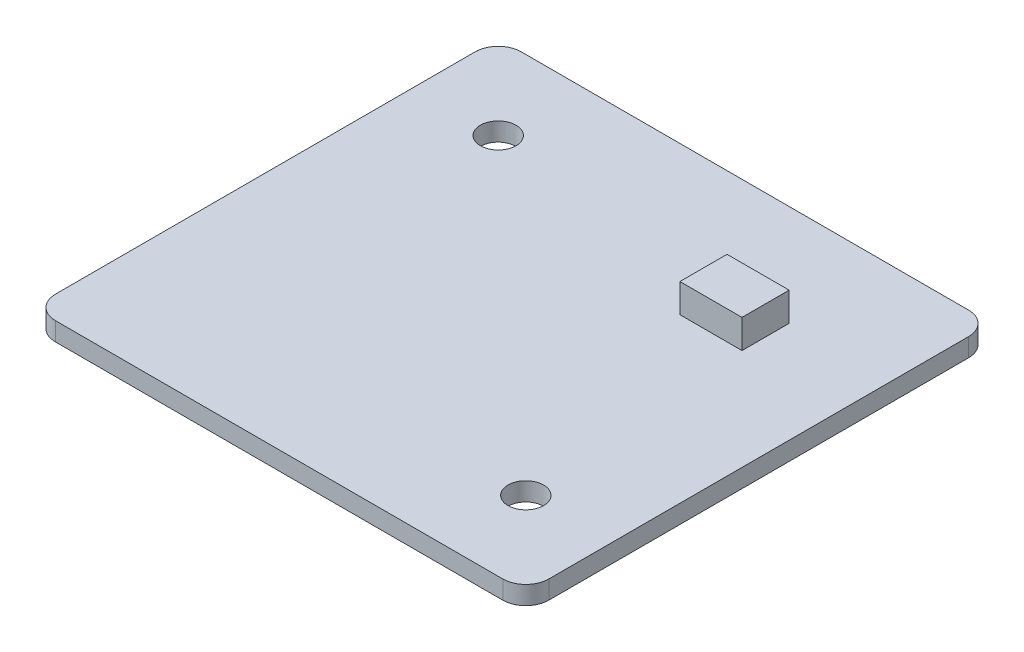
ISO-10303-21;
HEADER;
FILE_DESCRIPTION(('STEP AP214'),'2;1');
FILE_NAME('part.step','',(''),(''),'','','');
FILE_SCHEMA(('AUTOMOTIVE_DESIGN { 1 0 10303 214 1 1 1 1 }'));
ENDSEC;
DATA;
#1=APPLICATION_CONTEXT('core data for automotive mechanical design processes');
#2=APPLICATION_PROTOCOL_DEFINITION('international standard','automotive_design',2000,#1);
#3=PRODUCT_CONTEXT('',#1,'mechanical');
#4=PRODUCT('Part','Part','',(#3));
#5=PRODUCT_RELATED_PRODUCT_CATEGORY('part','',(#4));
#6=PRODUCT_DEFINITION_FORMATION('','',#4);
#7=PRODUCT_DEFINITION_CONTEXT('part definition',#1,'design');
#8=PRODUCT_DEFINITION('design','',#6,#7);
#9=PRODUCT_DEFINITION_SHAPE('','',#8);
#10=(LENGTH_UNIT() NAMED_UNIT(*) SI_UNIT(.MILLI.,.METRE.));
#11=(NAMED_UNIT(*) PLANE_ANGLE_UNIT() SI_UNIT($,.RADIAN.));
#12=(NAMED_UNIT(*) SI_UNIT($,.STERADIAN.) SOLID_ANGLE_UNIT());
#13=UNCERTAINTY_MEASURE_WITH_UNIT(LENGTH_MEASURE(1.E-05),#10,'distance_accuracy_value','');
#14=(GEOMETRIC_REPRESENTATION_CONTEXT(3) GLOBAL_UNCERTAINTY_ASSIGNED_CONTEXT((#13)) GLOBAL_UNIT_ASSIGNED_CONTEXT((#10,
#11,#12)) REPRESENTATION_CONTEXT('',''));
#15=CARTESIAN_POINT('',(0.,0.,0.));
#16=DIRECTION('',(0.,0.,1.));
#17=DIRECTION('',(1.,0.,0.));
#18=AXIS2_PLACEMENT_3D('',#15,#16,#17);
#19=CARTESIAN_POINT('',(0.,0.,0.));
#20=DIRECTION('',(0.,1.,0.));
#21=DIRECTION('',(0.,0.,1.));
#22=AXIS2_PLACEMENT_3D('',#19,#20,#21);
#23=PLANE('',#22);
#24=CARTESIAN_POINT('',(5.33072569364747,0.,3.8448984075977));
#25=DIRECTION('',(0.,1.,0.));
#26=DIRECTION('',(0.,0.,1.));
#27=AXIS2_PLACEMENT_3D('',#24,#25,#26);
#28=CIRCLE('',#27,1.55);
#29=CARTESIAN_POINT('',(5.33072569364747,0.,5.3948984075977));
#30=VERTEX_POINT('',#29);
#31=EDGE_CURVE('E200',#30,#30,#28,.T.);
#32=ORIENTED_EDGE('',*,*,#31,.T.);
#33=EDGE_LOOP('',(#32));
#34=FACE_BOUND('',#33,.T.);
#35=DIRECTION('',(1.,0.,0.));
#36=VECTOR('',#35,1.);
#37=CARTESIAN_POINT('',(-30.2692743063525,0.,11.1448984075977));
#38=LINE('',#37,#36);
#39=CARTESIAN_POINT('',(-28.2692743063525,0.,11.1448984075977));
#40=VERTEX_POINT('',#39);
#41=CARTESIAN_POINT('',(10.6307256936475,0.,11.1448984075977));
#42=VERTEX_POINT('',#41);
#43=EDGE_CURVE('E229',#40,#42,#38,.T.);
#44=ORIENTED_EDGE('',*,*,#43,.F.);
#45=CARTESIAN_POINT('',(-28.2692743063525,0.,9.1448984075977));
#46=DIRECTION('',(0.,1.,0.));
#47=DIRECTION('',(0.,0.,1.));
#48=AXIS2_PLACEMENT_3D('',#45,#46,#47);
#49=CIRCLE('',#48,2.);
#50=CARTESIAN_POINT('',(-30.2692743063525,0.,9.1448984075977));
#51=VERTEX_POINT('',#50);
#52=EDGE_CURVE('E247',#40,#51,#49,.F.);
#53=ORIENTED_EDGE('',*,*,#52,.T.);
#54=DIRECTION('',(0.,0.,1.));
#55=VECTOR('',#54,1.);
#56=CARTESIAN_POINT('',(-30.2692743063525,0.,-29.3551015924023));
#57=LINE('',#56,#55);
#58=CARTESIAN_POINT('',(-30.2692743063525,0.,-27.3551015924023));
#59=VERTEX_POINT('',#58);
#60=EDGE_CURVE('E210',#59,#51,#57,.T.);
#61=ORIENTED_EDGE('',*,*,#60,.F.);
#62=CARTESIAN_POINT('',(-28.2692743063525,0.,-27.3551015924023));
#63=DIRECTION('',(0.,1.,0.));
#64=DIRECTION('',(0.,0.,1.));
#65=AXIS2_PLACEMENT_3D('',#62,#63,#64);
#66=CIRCLE('',#65,2.);
#67=CARTESIAN_POINT('',(-28.2692743063525,0.,-29.3551015924023));
#68=VERTEX_POINT('',#67);
#69=EDGE_CURVE('E241',#59,#68,#66,.F.);
#70=ORIENTED_EDGE('',*,*,#69,.T.);
#71=DIRECTION('',(-1.,0.,0.));
#72=VECTOR('',#71,1.);
#73=CARTESIAN_POINT('',(-30.2692743063525,0.,-29.3551015924023));
#74=LINE('',#73,#72);
#75=CARTESIAN_POINT('',(10.6307256936475,0.,-29.3551015924023));
#76=VERTEX_POINT('',#75);
#77=EDGE_CURVE('E217',#76,#68,#74,.T.);
#78=ORIENTED_EDGE('',*,*,#77,.F.);
#79=CARTESIAN_POINT('',(10.6307256936475,0.,-27.3551015924023));
#80=DIRECTION('',(0.,1.,0.));
#81=DIRECTION('',(0.,0.,1.));
#82=AXIS2_PLACEMENT_3D('',#79,#80,#81);
#83=CIRCLE('',#82,2.);
#84=CARTESIAN_POINT('',(12.6307256936475,0.,-27.3551015924023));
#85=VERTEX_POINT('',#84);
#86=EDGE_CURVE('E245',#76,#85,#83,.F.);
#87=ORIENTED_EDGE('',*,*,#86,.T.);
#88=DIRECTION('',(0.,0.,-1.));
#89=VECTOR('',#88,1.);
#90=CARTESIAN_POINT('',(12.6307256936475,0.,-29.3551015924023));
#91=LINE('',#90,#89);
#92=CARTESIAN_POINT('',(12.6307256936475,0.,9.1448984075977));
#93=VERTEX_POINT('',#92);
#94=EDGE_CURVE('E232',#93,#85,#91,.T.);
#95=ORIENTED_EDGE('',*,*,#94,.F.);
#96=CARTESIAN_POINT('',(10.6307256936475,0.,9.1448984075977));
#97=DIRECTION('',(0.,1.,0.));
#98=DIRECTION('',(0.,0.,1.));
#99=AXIS2_PLACEMENT_3D('',#96,#97,#98);
#100=CIRCLE('',#99,2.);
#101=EDGE_CURVE('E243',#93,#42,#100,.F.);
#102=ORIENTED_EDGE('',*,*,#101,.T.);
#103=EDGE_LOOP('',(#44,#53,#61,#70,#78,#87,#95,#102));
#104=FACE_BOUND('',#103,.T.);
#105=CARTESIAN_POINT('',(-22.9692743063525,0.,-22.0551015924023));
#106=DIRECTION('',(0.,1.,0.));
#107=DIRECTION('',(0.,0.,1.));
#108=AXIS2_PLACEMENT_3D('',#105,#106,#107);
#109=CIRCLE('',#108,1.55);
#110=CARTESIAN_POINT('',(-22.9692743063525,0.,-20.5051015924023));
#111=VERTEX_POINT('',#110);
#112=EDGE_CURVE('E204',#111,#111,#109,.T.);
#113=ORIENTED_EDGE('',*,*,#112,.T.);
#114=EDGE_LOOP('',(#113));
#115=FACE_BOUND('',#114,.T.);
#116=DIRECTION('',(0.,0.,-1.));
#117=VECTOR('',#116,1.);
#118=CARTESIAN_POINT('',(-21.6692743063525,0.,5.8948984075977));
#119=LINE('',#118,#117);
#120=CARTESIAN_POINT('',(-21.6692743063525,0.,5.8948984075977));
#121=VERTEX_POINT('',#120);
#122=CARTESIAN_POINT('',(-21.6692743063525,0.,3.3348984075977));
#123=VERTEX_POINT('',#122);
#124=EDGE_CURVE('E165',#121,#123,#119,.T.);
#125=ORIENTED_EDGE('',*,*,#124,.F.);
#126=DIRECTION('',(-1.,0.,0.));
#127=VECTOR('',#126,1.);
#128=CARTESIAN_POINT('',(-21.6692743063525,0.,5.8948984075977));
#129=LINE('',#128,#127);
#130=CARTESIAN_POINT('',(-1.16927430635253,0.,5.8948984075977));
#131=VERTEX_POINT('',#130);
#132=EDGE_CURVE('E162',#131,#121,#129,.T.);
#133=ORIENTED_EDGE('',*,*,#132,.F.);
#134=DIRECTION('',(0.,0.,1.));
#135=VECTOR('',#134,1.);
#136=CARTESIAN_POINT('',(-1.16927430635253,0.,5.8948984075977));
#137=LINE('',#136,#135);
#138=CARTESIAN_POINT('',(-1.16927430635253,0.,3.3348984075977));
#139=VERTEX_POINT('',#138);
#140=EDGE_CURVE('E53',#139,#131,#137,.T.);
#141=ORIENTED_EDGE('',*,*,#140,.F.);
#142=DIRECTION('',(1.,0.,0.));
#143=VECTOR('',#142,1.);
#144=CARTESIAN_POINT('',(-21.6692743063525,0.,3.3348984075977));
#145=LINE('',#144,#143);
#146=EDGE_CURVE('E48',#123,#139,#145,.T.);
#147=ORIENTED_EDGE('',*,*,#146,.F.);
#148=EDGE_LOOP('',(#125,#133,#141,#147));
#149=FACE_BOUND('',#148,.T.);
#150=ADVANCED_FACE('F33',(#34,#104,#115,#149),#23,.F.);
#151=CARTESIAN_POINT('',(0.,1.6,0.));
#152=DIRECTION('',(0.,1.,0.));
#153=DIRECTION('',(0.,0.,1.));
#154=AXIS2_PLACEMENT_3D('',#151,#152,#153);
#155=PLANE('',#154);
#156=CARTESIAN_POINT('',(5.33072569364747,1.6,3.8448984075977));
#157=DIRECTION('',(0.,1.,0.));
#158=DIRECTION('',(0.,0.,1.));
#159=AXIS2_PLACEMENT_3D('',#156,#157,#158);
#160=CIRCLE('',#159,1.55);
#161=CARTESIAN_POINT('',(5.33072569364747,1.6,5.3948984075977));
#162=VERTEX_POINT('',#161);
#163=EDGE_CURVE('E201',#162,#162,#160,.T.);
#164=ORIENTED_EDGE('',*,*,#163,.F.);
#165=EDGE_LOOP('',(#164));
#166=FACE_BOUND('',#165,.T.);
#167=DIRECTION('',(0.,0.,1.));
#168=VECTOR('',#167,1.);
#169=CARTESIAN_POINT('',(-30.2692743063525,1.6,-29.3551015924023));
#170=LINE('',#169,#168);
#171=CARTESIAN_POINT('',(-30.2692743063525,1.6,-27.3551015924023));
#172=VERTEX_POINT('',#171);
#173=CARTESIAN_POINT('',(-30.2692743063525,1.6,9.1448984075977));
#174=VERTEX_POINT('',#173);
#175=EDGE_CURVE('E213',#172,#174,#170,.T.);
#176=ORIENTED_EDGE('',*,*,#175,.T.);
#177=CARTESIAN_POINT('',(-28.2692743063525,1.6,9.1448984075977));
#178=DIRECTION('',(0.,1.,0.));
#179=DIRECTION('',(0.,0.,1.));
#180=AXIS2_PLACEMENT_3D('',#177,#178,#179);
#181=CIRCLE('',#180,2.);
#182=CARTESIAN_POINT('',(-28.2692743063525,1.6,11.1448984075977));
#183=VERTEX_POINT('',#182);
#184=EDGE_CURVE('E260',#174,#183,#181,.T.);
#185=ORIENTED_EDGE('',*,*,#184,.T.);
#186=DIRECTION('',(1.,0.,0.));
#187=VECTOR('',#186,1.);
#188=CARTESIAN_POINT('',(-30.2692743063525,1.6,11.1448984075977));
#189=LINE('',#188,#187);
#190=CARTESIAN_POINT('',(10.6307256936475,1.6,11.1448984075977));
#191=VERTEX_POINT('',#190);
#192=EDGE_CURVE('E216',#183,#191,#189,.T.);
#193=ORIENTED_EDGE('',*,*,#192,.T.);
#194=CARTESIAN_POINT('',(10.6307256936475,1.6,9.1448984075977));
#195=DIRECTION('',(0.,1.,0.));
#196=DIRECTION('',(0.,0.,1.));
#197=AXIS2_PLACEMENT_3D('',#194,#195,#196);
#198=CIRCLE('',#197,2.);
#199=CARTESIAN_POINT('',(12.6307256936475,1.6,9.1448984075977));
#200=VERTEX_POINT('',#199);
#201=EDGE_CURVE('E256',#191,#200,#198,.T.);
#202=ORIENTED_EDGE('',*,*,#201,.T.);
#203=DIRECTION('',(0.,0.,-1.));
#204=VECTOR('',#203,1.);
#205=CARTESIAN_POINT('',(12.6307256936475,1.6,-29.3551015924023));
#206=LINE('',#205,#204);
#207=CARTESIAN_POINT('',(12.6307256936475,1.6,-27.3551015924023));
#208=VERTEX_POINT('',#207);
#209=EDGE_CURVE('E220',#200,#208,#206,.T.);
#210=ORIENTED_EDGE('',*,*,#209,.T.);
#211=CARTESIAN_POINT('',(10.6307256936475,1.6,-27.3551015924023));
#212=DIRECTION('',(0.,1.,0.));
#213=DIRECTION('',(0.,0.,1.));
#214=AXIS2_PLACEMENT_3D('',#211,#212,#213);
#215=CIRCLE('',#214,2.);
#216=CARTESIAN_POINT('',(10.6307256936475,1.6,-29.3551015924023));
#217=VERTEX_POINT('',#216);
#218=EDGE_CURVE('E258',#208,#217,#215,.T.);
#219=ORIENTED_EDGE('',*,*,#218,.T.);
#220=DIRECTION('',(-1.,0.,0.));
#221=VECTOR('',#220,1.);
#222=CARTESIAN_POINT('',(-30.2692743063525,1.6,-29.3551015924023));
#223=LINE('',#222,#221);
#224=CARTESIAN_POINT('',(-28.2692743063525,1.6,-29.3551015924023));
#225=VERTEX_POINT('',#224);
#226=EDGE_CURVE('E223',#217,#225,#223,.T.);
#227=ORIENTED_EDGE('',*,*,#226,.T.);
#228=CARTESIAN_POINT('',(-28.2692743063525,1.6,-27.3551015924023));
#229=DIRECTION('',(0.,1.,0.));
#230=DIRECTION('',(0.,0.,1.));
#231=AXIS2_PLACEMENT_3D('',#228,#229,#230);
#232=CIRCLE('',#231,2.);
#233=EDGE_CURVE('E254',#225,#172,#232,.T.);
#234=ORIENTED_EDGE('',*,*,#233,.T.);
#235=EDGE_LOOP('',(#176,#185,#193,#202,#210,#219,#227,#234));
#236=FACE_BOUND('',#235,.T.);
#237=CARTESIAN_POINT('',(-22.9692743063525,1.6,-22.0551015924023));
#238=DIRECTION('',(0.,1.,0.));
#239=DIRECTION('',(0.,0.,1.));
#240=AXIS2_PLACEMENT_3D('',#237,#238,#239);
#241=CIRCLE('',#240,1.55);
#242=CARTESIAN_POINT('',(-22.9692743063525,1.6,-20.5051015924023));
#243=VERTEX_POINT('',#242);
#244=EDGE_CURVE('E207',#243,#243,#241,.T.);
#245=ORIENTED_EDGE('',*,*,#244,.F.);
#246=EDGE_LOOP('',(#245));
#247=FACE_BOUND('',#246,.T.);
#248=DIRECTION('',(1.,0.,0.));
#249=VECTOR('',#248,1.);
#250=CARTESIAN_POINT('',(-1.56927430635253,1.6,-16.4551015924023));
#251=LINE('',#250,#249);
#252=CARTESIAN_POINT('',(-1.56927430635253,1.6,-16.4551015924023));
#253=VERTEX_POINT('',#252);
#254=CARTESIAN_POINT('',(3.83072569364747,1.6,-16.4551015924023));
#255=VERTEX_POINT('',#254);
#256=EDGE_CURVE('E169',#253,#255,#251,.T.);
#257=ORIENTED_EDGE('',*,*,#256,.F.);
#258=DIRECTION('',(0.,0.,1.));
#259=VECTOR('',#258,1.);
#260=CARTESIAN_POINT('',(-1.56927430635253,1.6,-20.5551015924023));
#261=LINE('',#260,#259);
#262=CARTESIAN_POINT('',(-1.56927430635253,1.6,-20.5551015924023));
#263=VERTEX_POINT('',#262);
#264=EDGE_CURVE('E166',#263,#253,#261,.T.);
#265=ORIENTED_EDGE('',*,*,#264,.F.);
#266=DIRECTION('',(-1.,0.,0.));
#267=VECTOR('',#266,1.);
#268=CARTESIAN_POINT('',(-1.56927430635253,1.6,-20.5551015924023));
#269=LINE('',#268,#267);
#270=CARTESIAN_POINT('',(3.83072569364747,1.6,-20.5551015924023));
#271=VERTEX_POINT('',#270);
#272=EDGE_CURVE('E179',#271,#263,#269,.T.);
#273=ORIENTED_EDGE('',*,*,#272,.F.);
#274=DIRECTION('',(0.,0.,-1.));
#275=VECTOR('',#274,1.);
#276=CARTESIAN_POINT('',(3.83072569364747,1.6,-20.5551015924023));
#277=LINE('',#276,#275);
#278=EDGE_CURVE('E187',#255,#271,#277,.T.);
#279=ORIENTED_EDGE('',*,*,#278,.F.);
#280=EDGE_LOOP('',(#257,#265,#273,#279));
#281=FACE_BOUND('',#280,.T.);
#282=ADVANCED_FACE('F289',(#166,#236,#247,#281),#155,.T.);
#283=CARTESIAN_POINT('',(-30.2692743063525,1.6,-29.3551015924023));
#284=DIRECTION('',(1.,0.,0.));
#285=DIRECTION('',(0.,0.,-1.));
#286=AXIS2_PLACEMENT_3D('',#283,#284,#285);
#287=PLANE('',#286);
#288=ORIENTED_EDGE('',*,*,#60,.T.);
#289=DIRECTION('',(0.,-1.,0.));
#290=VECTOR('',#289,1.);
#291=CARTESIAN_POINT('',(-30.2692743063525,1.6,9.1448984075977));
#292=LINE('',#291,#290);
#293=EDGE_CURVE('E252',#51,#174,#292,.F.);
#294=ORIENTED_EDGE('',*,*,#293,.T.);
#295=ORIENTED_EDGE('',*,*,#175,.F.);
#296=DIRECTION('',(0.,-1.,0.));
#297=VECTOR('',#296,1.);
#298=CARTESIAN_POINT('',(-30.2692743063525,1.6,-27.3551015924023));
#299=LINE('',#298,#297);
#300=EDGE_CURVE('E249',#172,#59,#299,.T.);
#301=ORIENTED_EDGE('',*,*,#300,.T.);
#302=EDGE_LOOP('',(#288,#294,#295,#301));
#303=FACE_BOUND('',#302,.T.);
#304=ADVANCED_FACE('F296',(#303),#287,.F.);
#305=CARTESIAN_POINT('',(-30.2692743063525,1.6,11.1448984075977));
#306=DIRECTION('',(0.,0.,-1.));
#307=DIRECTION('',(-1.,0.,0.));
#308=AXIS2_PLACEMENT_3D('',#305,#306,#307);
#309=PLANE('',#308);
#310=ORIENTED_EDGE('',*,*,#192,.F.);
#311=DIRECTION('',(0.,-1.,0.));
#312=VECTOR('',#311,1.);
#313=CARTESIAN_POINT('',(-28.2692743063525,1.6,11.1448984075977));
#314=LINE('',#313,#312);
#315=EDGE_CURVE('E238',#183,#40,#314,.T.);
#316=ORIENTED_EDGE('',*,*,#315,.T.);
#317=ORIENTED_EDGE('',*,*,#43,.T.);
#318=DIRECTION('',(0.,-1.,0.));
#319=VECTOR('',#318,1.);
#320=CARTESIAN_POINT('',(10.6307256936475,1.6,11.1448984075977));
#321=LINE('',#320,#319);
#322=EDGE_CURVE('E226',#42,#191,#321,.F.);
#323=ORIENTED_EDGE('',*,*,#322,.T.);
#324=EDGE_LOOP('',(#310,#316,#317,#323));
#325=FACE_BOUND('',#324,.T.);
#326=ADVANCED_FACE('F304',(#325),#309,.F.);
#327=CARTESIAN_POINT('',(12.6307256936475,1.6,-29.3551015924023));
#328=DIRECTION('',(-1.,0.,0.));
#329=DIRECTION('',(0.,0.,1.));
#330=AXIS2_PLACEMENT_3D('',#327,#328,#329);
#331=PLANE('',#330);
#332=ORIENTED_EDGE('',*,*,#94,.T.);
#333=DIRECTION('',(0.,-1.,0.));
#334=VECTOR('',#333,1.);
#335=CARTESIAN_POINT('',(12.6307256936475,1.6,-27.3551015924023));
#336=LINE('',#335,#334);
#337=EDGE_CURVE('E11',#85,#208,#336,.F.);
#338=ORIENTED_EDGE('',*,*,#337,.T.);
#339=ORIENTED_EDGE('',*,*,#209,.F.);
#340=DIRECTION('',(0.,-1.,0.));
#341=VECTOR('',#340,1.);
#342=CARTESIAN_POINT('',(12.6307256936475,1.6,9.1448984075977));
#343=LINE('',#342,#341);
#344=EDGE_CURVE('E41',#200,#93,#343,.T.);
#345=ORIENTED_EDGE('',*,*,#344,.T.);
#346=EDGE_LOOP('',(#332,#338,#339,#345));
#347=FACE_BOUND('',#346,.T.);
#348=ADVANCED_FACE('F271',(#347),#331,.F.);
#349=CARTESIAN_POINT('',(-30.2692743063525,1.6,-29.3551015924023));
#350=DIRECTION('',(0.,0.,1.));
#351=DIRECTION('',(1.,0.,0.));
#352=AXIS2_PLACEMENT_3D('',#349,#350,#351);
#353=PLANE('',#352);
#354=ORIENTED_EDGE('',*,*,#226,.F.);
#355=DIRECTION('',(0.,-1.,0.));
#356=VECTOR('',#355,1.);
#357=CARTESIAN_POINT('',(10.6307256936475,1.6,-29.3551015924023));
#358=LINE('',#357,#356);
#359=EDGE_CURVE('E264',#217,#76,#358,.T.);
#360=ORIENTED_EDGE('',*,*,#359,.T.);
#361=ORIENTED_EDGE('',*,*,#77,.T.);
#362=DIRECTION('',(0.,-1.,0.));
#363=VECTOR('',#362,1.);
#364=CARTESIAN_POINT('',(-28.2692743063525,1.6,-29.3551015924023));
#365=LINE('',#364,#363);
#366=EDGE_CURVE('E262',#68,#225,#365,.F.);
#367=ORIENTED_EDGE('',*,*,#366,.T.);
#368=EDGE_LOOP('',(#354,#360,#361,#367));
#369=FACE_BOUND('',#368,.T.);
#370=ADVANCED_FACE('F285',(#369),#353,.F.);
#371=CARTESIAN_POINT('',(-22.9692743063525,1.6,-22.0551015924023));
#372=DIRECTION('',(0.,-1.,0.));
#373=DIRECTION('',(0.,0.,-1.));
#374=AXIS2_PLACEMENT_3D('',#371,#372,#373);
#375=CYLINDRICAL_SURFACE('',#374,1.55);
#376=ORIENTED_EDGE('',*,*,#244,.T.);
#377=EDGE_LOOP('',(#376));
#378=FACE_BOUND('',#377,.T.);
#379=ORIENTED_EDGE('',*,*,#112,.F.);
#380=EDGE_LOOP('',(#379));
#381=FACE_BOUND('',#380,.T.);
#382=ADVANCED_FACE('F326',(#378,#381),#375,.F.);
#383=CARTESIAN_POINT('',(5.33072569364747,1.6,3.8448984075977));
#384=DIRECTION('',(0.,-1.,0.));
#385=DIRECTION('',(0.,0.,-1.));
#386=AXIS2_PLACEMENT_3D('',#383,#384,#385);
#387=CYLINDRICAL_SURFACE('',#386,1.55);
#388=ORIENTED_EDGE('',*,*,#163,.T.);
#389=EDGE_LOOP('',(#388));
#390=FACE_BOUND('',#389,.T.);
#391=ORIENTED_EDGE('',*,*,#31,.F.);
#392=EDGE_LOOP('',(#391));
#393=FACE_BOUND('',#392,.T.);
#394=ADVANCED_FACE('F334',(#390,#393),#387,.F.);
#395=CARTESIAN_POINT('',(-28.2692743063525,1.6,9.1448984075977));
#396=DIRECTION('',(0.,-1.,0.));
#397=DIRECTION('',(0.,0.,-1.));
#398=AXIS2_PLACEMENT_3D('',#395,#396,#397);
#399=CYLINDRICAL_SURFACE('',#398,2.);
#400=ORIENTED_EDGE('',*,*,#184,.F.);
#401=ORIENTED_EDGE('',*,*,#293,.F.);
#402=ORIENTED_EDGE('',*,*,#52,.F.);
#403=ORIENTED_EDGE('',*,*,#315,.F.);
#404=EDGE_LOOP('',(#400,#401,#402,#403));
#405=FACE_BOUND('',#404,.T.);
#406=ADVANCED_FACE('F301',(#405),#399,.T.);
#407=CARTESIAN_POINT('',(10.6307256936475,1.6,-27.3551015924023));
#408=DIRECTION('',(0.,-1.,0.));
#409=DIRECTION('',(0.,0.,-1.));
#410=AXIS2_PLACEMENT_3D('',#407,#408,#409);
#411=CYLINDRICAL_SURFACE('',#410,2.);
#412=ORIENTED_EDGE('',*,*,#218,.F.);
#413=ORIENTED_EDGE('',*,*,#337,.F.);
#414=ORIENTED_EDGE('',*,*,#86,.F.);
#415=ORIENTED_EDGE('',*,*,#359,.F.);
#416=EDGE_LOOP('',(#412,#413,#414,#415));
#417=FACE_BOUND('',#416,.T.);
#418=ADVANCED_FACE('F282',(#417),#411,.T.);
#419=CARTESIAN_POINT('',(10.6307256936475,1.6,9.1448984075977));
#420=DIRECTION('',(0.,-1.,0.));
#421=DIRECTION('',(0.,0.,-1.));
#422=AXIS2_PLACEMENT_3D('',#419,#420,#421);
#423=CYLINDRICAL_SURFACE('',#422,2.);
#424=ORIENTED_EDGE('',*,*,#201,.F.);
#425=ORIENTED_EDGE('',*,*,#322,.F.);
#426=ORIENTED_EDGE('',*,*,#101,.F.);
#427=ORIENTED_EDGE('',*,*,#344,.F.);
#428=EDGE_LOOP('',(#424,#425,#426,#427));
#429=FACE_BOUND('',#428,.T.);
#430=ADVANCED_FACE('F306',(#429),#423,.T.);
#431=CARTESIAN_POINT('',(-28.2692743063525,1.6,-27.3551015924023));
#432=DIRECTION('',(0.,-1.,0.));
#433=DIRECTION('',(0.,0.,-1.));
#434=AXIS2_PLACEMENT_3D('',#431,#432,#433);
#435=CYLINDRICAL_SURFACE('',#434,2.);
#436=ORIENTED_EDGE('',*,*,#233,.F.);
#437=ORIENTED_EDGE('',*,*,#366,.F.);
#438=ORIENTED_EDGE('',*,*,#69,.F.);
#439=ORIENTED_EDGE('',*,*,#300,.F.);
#440=EDGE_LOOP('',(#436,#437,#438,#439));
#441=FACE_BOUND('',#440,.T.);
#442=ADVANCED_FACE('F35',(#441),#435,.T.);
#443=CARTESIAN_POINT('',(-1.56927430635253,4.1,-20.5551015924023));
#444=DIRECTION('',(1.,0.,0.));
#445=DIRECTION('',(0.,0.,-1.));
#446=AXIS2_PLACEMENT_3D('',#443,#444,#445);
#447=PLANE('',#446);
#448=ORIENTED_EDGE('',*,*,#264,.T.);
#449=DIRECTION('',(0.,-1.,0.));
#450=VECTOR('',#449,1.);
#451=CARTESIAN_POINT('',(-1.56927430635253,4.1,-16.4551015924023));
#452=LINE('',#451,#450);
#453=CARTESIAN_POINT('',(-1.56927430635253,4.1,-16.4551015924023));
#454=VERTEX_POINT('',#453);
#455=EDGE_CURVE('E198',#454,#253,#452,.T.);
#456=ORIENTED_EDGE('',*,*,#455,.F.);
#457=DIRECTION('',(0.,0.,1.));
#458=VECTOR('',#457,1.);
#459=CARTESIAN_POINT('',(-1.56927430635253,4.1,-20.5551015924023));
#460=LINE('',#459,#458);
#461=CARTESIAN_POINT('',(-1.56927430635253,4.1,-20.5551015924023));
#462=VERTEX_POINT('',#461);
#463=EDGE_CURVE('E175',#462,#454,#460,.T.);
#464=ORIENTED_EDGE('',*,*,#463,.F.);
#465=DIRECTION('',(0.,-1.,0.));
#466=VECTOR('',#465,1.);
#467=CARTESIAN_POINT('',(-1.56927430635253,4.1,-20.5551015924023));
#468=LINE('',#467,#466);
#469=EDGE_CURVE('E184',#462,#263,#468,.T.);
#470=ORIENTED_EDGE('',*,*,#469,.T.);
#471=EDGE_LOOP('',(#448,#456,#464,#470));
#472=FACE_BOUND('',#471,.T.);
#473=ADVANCED_FACE('F312',(#472),#447,.F.);
#474=CARTESIAN_POINT('',(-1.56927430635253,4.1,-16.4551015924023));
#475=DIRECTION('',(0.,0.,-1.));
#476=DIRECTION('',(-1.,0.,0.));
#477=AXIS2_PLACEMENT_3D('',#474,#475,#476);
#478=PLANE('',#477);
#479=ORIENTED_EDGE('',*,*,#256,.T.);
#480=DIRECTION('',(0.,-1.,0.));
#481=VECTOR('',#480,1.);
#482=CARTESIAN_POINT('',(3.83072569364747,4.1,-16.4551015924023));
#483=LINE('',#482,#481);
#484=CARTESIAN_POINT('',(3.83072569364747,4.1,-16.4551015924023));
#485=VERTEX_POINT('',#484);
#486=EDGE_CURVE('E195',#485,#255,#483,.T.);
#487=ORIENTED_EDGE('',*,*,#486,.F.);
#488=DIRECTION('',(1.,0.,0.));
#489=VECTOR('',#488,1.);
#490=CARTESIAN_POINT('',(-1.56927430635253,4.1,-16.4551015924023));
#491=LINE('',#490,#489);
#492=EDGE_CURVE('E178',#454,#485,#491,.T.);
#493=ORIENTED_EDGE('',*,*,#492,.F.);
#494=ORIENTED_EDGE('',*,*,#455,.T.);
#495=EDGE_LOOP('',(#479,#487,#493,#494));
#496=FACE_BOUND('',#495,.T.);
#497=ADVANCED_FACE('F348',(#496),#478,.F.);
#498=CARTESIAN_POINT('',(3.83072569364747,4.1,-20.5551015924023));
#499=DIRECTION('',(-1.,0.,0.));
#500=DIRECTION('',(0.,0.,1.));
#501=AXIS2_PLACEMENT_3D('',#498,#499,#500);
#502=PLANE('',#501);
#503=ORIENTED_EDGE('',*,*,#278,.T.);
#504=DIRECTION('',(0.,-1.,0.));
#505=VECTOR('',#504,1.);
#506=CARTESIAN_POINT('',(3.83072569364747,4.1,-20.5551015924023));
#507=LINE('',#506,#505);
#508=CARTESIAN_POINT('',(3.83072569364747,4.1,-20.5551015924023));
#509=VERTEX_POINT('',#508);
#510=EDGE_CURVE('E193',#509,#271,#507,.T.);
#511=ORIENTED_EDGE('',*,*,#510,.F.);
#512=DIRECTION('',(0.,0.,-1.));
#513=VECTOR('',#512,1.);
#514=CARTESIAN_POINT('',(3.83072569364747,4.1,-20.5551015924023));
#515=LINE('',#514,#513);
#516=EDGE_CURVE('E181',#485,#509,#515,.T.);
#517=ORIENTED_EDGE('',*,*,#516,.F.);
#518=ORIENTED_EDGE('',*,*,#486,.T.);
#519=EDGE_LOOP('',(#503,#511,#517,#518));
#520=FACE_BOUND('',#519,.T.);
#521=ADVANCED_FACE('F352',(#520),#502,.F.);
#522=CARTESIAN_POINT('',(-1.56927430635253,4.1,-20.5551015924023));
#523=DIRECTION('',(0.,0.,1.));
#524=DIRECTION('',(1.,0.,0.));
#525=AXIS2_PLACEMENT_3D('',#522,#523,#524);
#526=PLANE('',#525);
#527=ORIENTED_EDGE('',*,*,#272,.T.);
#528=ORIENTED_EDGE('',*,*,#469,.F.);
#529=DIRECTION('',(-1.,0.,0.));
#530=VECTOR('',#529,1.);
#531=CARTESIAN_POINT('',(-1.56927430635253,4.1,-20.5551015924023));
#532=LINE('',#531,#530);
#533=EDGE_CURVE('E183',#509,#462,#532,.T.);
#534=ORIENTED_EDGE('',*,*,#533,.F.);
#535=ORIENTED_EDGE('',*,*,#510,.T.);
#536=EDGE_LOOP('',(#527,#528,#534,#535));
#537=FACE_BOUND('',#536,.T.);
#538=ADVANCED_FACE('F356',(#537),#526,.F.);
#539=CARTESIAN_POINT('',(0.,4.1,0.));
#540=DIRECTION('',(0.,1.,0.));
#541=DIRECTION('',(0.,0.,1.));
#542=AXIS2_PLACEMENT_3D('',#539,#540,#541);
#543=PLANE('',#542);
#544=ORIENTED_EDGE('',*,*,#463,.T.);
#545=ORIENTED_EDGE('',*,*,#492,.T.);
#546=ORIENTED_EDGE('',*,*,#516,.T.);
#547=ORIENTED_EDGE('',*,*,#533,.T.);
#548=EDGE_LOOP('',(#544,#545,#546,#547));
#549=FACE_BOUND('',#548,.T.);
#550=ADVANCED_FACE('F360',(#549),#543,.T.);
#551=CARTESIAN_POINT('',(-21.6692743063525,-2.3,5.8948984075977));
#552=DIRECTION('',(1.,0.,0.));
#553=DIRECTION('',(0.,0.,-1.));
#554=AXIS2_PLACEMENT_3D('',#551,#552,#553);
#555=PLANE('',#554);
#556=ORIENTED_EDGE('',*,*,#124,.T.);
#557=DIRECTION('',(0.,1.,0.));
#558=VECTOR('',#557,1.);
#559=CARTESIAN_POINT('',(-21.6692743063525,-2.3,3.3348984075977));
#560=LINE('',#559,#558);
#561=CARTESIAN_POINT('',(-21.6692743063525,-2.3,3.3348984075977));
#562=VERTEX_POINT('',#561);
#563=EDGE_CURVE('E146',#562,#123,#560,.T.);
#564=ORIENTED_EDGE('',*,*,#563,.F.);
#565=DIRECTION('',(0.,0.,-1.));
#566=VECTOR('',#565,1.);
#567=CARTESIAN_POINT('',(-21.6692743063525,-2.3,5.8948984075977));
#568=LINE('',#567,#566);
#569=CARTESIAN_POINT('',(-21.6692743063525,-2.3,5.8948984075977));
#570=VERTEX_POINT('',#569);
#571=EDGE_CURVE('E153',#570,#562,#568,.T.);
#572=ORIENTED_EDGE('',*,*,#571,.F.);
#573=DIRECTION('',(0.,1.,0.));
#574=VECTOR('',#573,1.);
#575=CARTESIAN_POINT('',(-21.6692743063525,-2.3,5.8948984075977));
#576=LINE('',#575,#574);
#577=EDGE_CURVE('E504',#570,#121,#576,.T.);
#578=ORIENTED_EDGE('',*,*,#577,.T.);
#579=EDGE_LOOP('',(#556,#564,#572,#578));
#580=FACE_BOUND('',#579,.T.);
#581=ADVANCED_FACE('F164',(#580),#555,.F.);
#582=CARTESIAN_POINT('',(-21.6692743063525,-2.3,3.3348984075977));
#583=DIRECTION('',(0.,0.,1.));
#584=DIRECTION('',(1.,0.,0.));
#585=AXIS2_PLACEMENT_3D('',#582,#583,#584);
#586=PLANE('',#585);
#587=ORIENTED_EDGE('',*,*,#146,.T.);
#588=DIRECTION('',(0.,1.,0.));
#589=VECTOR('',#588,1.);
#590=CARTESIAN_POINT('',(-1.16927430635253,-2.3,3.3348984075977));
#591=LINE('',#590,#589);
#592=CARTESIAN_POINT('',(-1.16927430635253,-2.3,3.3348984075977));
#593=VERTEX_POINT('',#592);
#594=EDGE_CURVE('E149',#593,#139,#591,.T.);
#595=ORIENTED_EDGE('',*,*,#594,.F.);
#596=DIRECTION('',(1.,0.,0.));
#597=VECTOR('',#596,1.);
#598=CARTESIAN_POINT('',(-21.6692743063525,-2.3,3.3348984075977));
#599=LINE('',#598,#597);
#600=EDGE_CURVE('E142',#562,#593,#599,.T.);
#601=ORIENTED_EDGE('',*,*,#600,.F.);
#602=ORIENTED_EDGE('',*,*,#563,.T.);
#603=EDGE_LOOP('',(#587,#595,#601,#602));
#604=FACE_BOUND('',#603,.T.);
#605=ADVANCED_FACE('F144',(#604),#586,.F.);
#606=CARTESIAN_POINT('',(-1.16927430635253,-2.3,5.8948984075977));
#607=DIRECTION('',(-1.,0.,0.));
#608=DIRECTION('',(0.,0.,1.));
#609=AXIS2_PLACEMENT_3D('',#606,#607,#608);
#610=PLANE('',#609);
#611=ORIENTED_EDGE('',*,*,#140,.T.);
#612=DIRECTION('',(0.,1.,0.));
#613=VECTOR('',#612,1.);
#614=CARTESIAN_POINT('',(-1.16927430635253,-2.3,5.8948984075977));
#615=LINE('',#614,#613);
#616=CARTESIAN_POINT('',(-1.16927430635253,-2.3,5.8948984075977));
#617=VERTEX_POINT('',#616);
#618=EDGE_CURVE('E171',#617,#131,#615,.T.);
#619=ORIENTED_EDGE('',*,*,#618,.F.);
#620=DIRECTION('',(0.,0.,1.));
#621=VECTOR('',#620,1.);
#622=CARTESIAN_POINT('',(-1.16927430635253,-2.3,5.8948984075977));
#623=LINE('',#622,#621);
#624=EDGE_CURVE('E152',#593,#617,#623,.T.);
#625=ORIENTED_EDGE('',*,*,#624,.F.);
#626=ORIENTED_EDGE('',*,*,#594,.T.);
#627=EDGE_LOOP('',(#611,#619,#625,#626));
#628=FACE_BOUND('',#627,.T.);
#629=ADVANCED_FACE('F369',(#628),#610,.F.);
#630=CARTESIAN_POINT('',(-21.6692743063525,-2.3,5.8948984075977));
#631=DIRECTION('',(0.,0.,-1.));
#632=DIRECTION('',(-1.,0.,0.));
#633=AXIS2_PLACEMENT_3D('',#630,#631,#632);
#634=PLANE('',#633);
#635=ORIENTED_EDGE('',*,*,#132,.T.);
#636=ORIENTED_EDGE('',*,*,#577,.F.);
#637=DIRECTION('',(-1.,0.,0.));
#638=VECTOR('',#637,1.);
#639=CARTESIAN_POINT('',(-21.6692743063525,-2.3,5.8948984075977));
#640=LINE('',#639,#638);
#641=EDGE_CURVE('E158',#617,#570,#640,.T.);
#642=ORIENTED_EDGE('',*,*,#641,.F.);
#643=ORIENTED_EDGE('',*,*,#618,.T.);
#644=EDGE_LOOP('',(#635,#636,#642,#643));
#645=FACE_BOUND('',#644,.T.);
#646=ADVANCED_FACE('F372',(#645),#634,.F.);
#647=CARTESIAN_POINT('',(0.,-2.3,0.));
#648=DIRECTION('',(0.,-1.,0.));
#649=DIRECTION('',(0.,0.,-1.));
#650=AXIS2_PLACEMENT_3D('',#647,#648,#649);
#651=PLANE('',#650);
#652=ORIENTED_EDGE('',*,*,#571,.T.);
#653=ORIENTED_EDGE('',*,*,#600,.T.);
#654=ORIENTED_EDGE('',*,*,#624,.T.);
#655=ORIENTED_EDGE('',*,*,#641,.T.);
#656=EDGE_LOOP('',(#652,#653,#654,#655));
#657=FACE_BOUND('',#656,.T.);
#658=ADVANCED_FACE('F156',(#657),#651,.T.);
#659=CLOSED_SHELL('',(#150,#282,#304,#326,#348,#370,#382,#394,#406,#418,#430,#442,#473,#497,
#521,#538,#550,#581,#605,#629,#646,#658));
#660=MANIFOLD_SOLID_BREP('B2',#659);
#661=ADVANCED_BREP_SHAPE_REPRESENTATION('',(#18,#660),#14);
#662=SHAPE_DEFINITION_REPRESENTATION(#9,#661);
ENDSEC;
END-ISO-10303-21;
